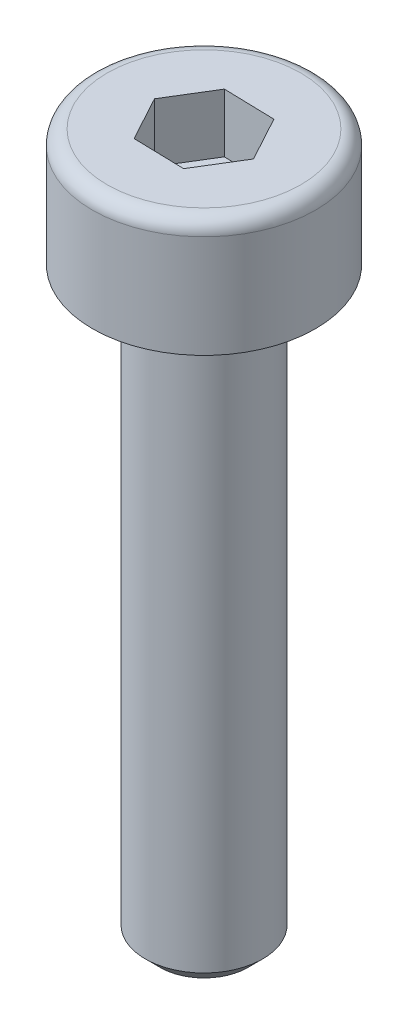
ISO-10303-21;
HEADER;
FILE_DESCRIPTION(('STEP AP214'),'2;1');
FILE_NAME('part.step','',(''),(''),'','','');
FILE_SCHEMA(('AUTOMOTIVE_DESIGN { 1 0 10303 214 1 1 1 1 }'));
ENDSEC;
DATA;
#1=APPLICATION_CONTEXT('core data for automotive mechanical design processes');
#2=APPLICATION_PROTOCOL_DEFINITION('international standard','automotive_design',2000,#1);
#3=PRODUCT_CONTEXT('',#1,'mechanical');
#4=PRODUCT('Part','Part','',(#3));
#5=PRODUCT_RELATED_PRODUCT_CATEGORY('part','',(#4));
#6=PRODUCT_DEFINITION_FORMATION('','',#4);
#7=PRODUCT_DEFINITION_CONTEXT('part definition',#1,'design');
#8=PRODUCT_DEFINITION('design','',#6,#7);
#9=PRODUCT_DEFINITION_SHAPE('','',#8);
#10=(LENGTH_UNIT() NAMED_UNIT(*) SI_UNIT(.MILLI.,.METRE.));
#11=(NAMED_UNIT(*) PLANE_ANGLE_UNIT() SI_UNIT($,.RADIAN.));
#12=(NAMED_UNIT(*) SI_UNIT($,.STERADIAN.) SOLID_ANGLE_UNIT());
#13=UNCERTAINTY_MEASURE_WITH_UNIT(LENGTH_MEASURE(1.E-05),#10,'distance_accuracy_value','');
#14=(GEOMETRIC_REPRESENTATION_CONTEXT(3) GLOBAL_UNCERTAINTY_ASSIGNED_CONTEXT((#13)) GLOBAL_UNIT_ASSIGNED_CONTEXT((#10,
#11,#12)) REPRESENTATION_CONTEXT('',''));
#15=CARTESIAN_POINT('',(0.,0.,0.));
#16=DIRECTION('',(0.,0.,1.));
#17=DIRECTION('',(1.,0.,0.));
#18=AXIS2_PLACEMENT_3D('',#15,#16,#17);
#19=CARTESIAN_POINT('',(0.,2.,0.));
#20=DIRECTION('',(0.,-1.,0.));
#21=DIRECTION('',(0.,0.,-1.));
#22=AXIS2_PLACEMENT_3D('',#19,#20,#21);
#23=CYLINDRICAL_SURFACE('',#22,1.9);
#24=CARTESIAN_POINT('',(0.,1.75,0.));
#25=DIRECTION('',(0.,1.,0.));
#26=DIRECTION('',(0.,0.,1.));
#27=AXIS2_PLACEMENT_3D('',#24,#25,#26);
#28=CIRCLE('',#27,1.9);
#29=CARTESIAN_POINT('',(0.,1.75,1.9));
#30=VERTEX_POINT('',#29);
#31=EDGE_CURVE('E148',#30,#30,#28,.F.);
#32=ORIENTED_EDGE('',*,*,#31,.T.);
#33=EDGE_LOOP('',(#32));
#34=FACE_BOUND('',#33,.T.);
#35=CARTESIAN_POINT('',(0.,0.,0.));
#36=DIRECTION('',(0.,1.,0.));
#37=DIRECTION('',(0.,0.,1.));
#38=AXIS2_PLACEMENT_3D('',#35,#36,#37);
#39=CIRCLE('',#38,1.9);
#40=CARTESIAN_POINT('',(0.,0.,1.9));
#41=VERTEX_POINT('',#40);
#42=EDGE_CURVE('E139',#41,#41,#39,.T.);
#43=ORIENTED_EDGE('',*,*,#42,.T.);
#44=EDGE_LOOP('',(#43));
#45=FACE_BOUND('',#44,.T.);
#46=ADVANCED_FACE('F37',(#34,#45),#23,.T.);
#47=CARTESIAN_POINT('',(0.,2.,0.));
#48=DIRECTION('',(0.,1.,0.));
#49=DIRECTION('',(0.,0.,1.));
#50=AXIS2_PLACEMENT_3D('',#47,#48,#49);
#51=PLANE('',#50);
#52=DIRECTION('',(-0.477309128780898,0.,-0.878735452558061));
#53=VECTOR('',#52,1.);
#54=CARTESIAN_POINT('',(0.865732504909784,2.,0.0225217659749745));
#55=LINE('',#54,#53);
#56=CARTESIAN_POINT('',(0.865732504909784,2.,0.0225217659749745));
#57=VERTEX_POINT('',#56);
#58=CARTESIAN_POINT('',(0.452370673927308,2.,-0.738485459146322));
#59=VERTEX_POINT('',#58);
#60=EDGE_CURVE('E52',#57,#59,#55,.T.);
#61=ORIENTED_EDGE('',*,*,#60,.F.);
#62=DIRECTION('',(0.522352660730847,0.,-0.852729557261506));
#63=VECTOR('',#62,1.);
#64=CARTESIAN_POINT('',(0.413361830982476,2.,0.761007225121296));
#65=LINE('',#64,#63);
#66=CARTESIAN_POINT('',(0.413361830982476,2.,0.761007225121296));
#67=VERTEX_POINT('',#66);
#68=EDGE_CURVE('E135',#67,#57,#65,.T.);
#69=ORIENTED_EDGE('',*,*,#68,.F.);
#70=DIRECTION('',(0.999661789511745,0.,0.0260058952965545));
#71=VECTOR('',#70,1.);
#72=CARTESIAN_POINT('',(-0.452370673927308,2.,0.738485459146322));
#73=LINE('',#72,#71);
#74=CARTESIAN_POINT('',(-0.452370673927308,2.,0.738485459146322));
#75=VERTEX_POINT('',#74);
#76=EDGE_CURVE('E133',#75,#67,#73,.T.);
#77=ORIENTED_EDGE('',*,*,#76,.F.);
#78=DIRECTION('',(0.477309128780898,0.,0.878735452558061));
#79=VECTOR('',#78,1.);
#80=CARTESIAN_POINT('',(-0.865732504909783,2.,-0.0225217659749746));
#81=LINE('',#80,#79);
#82=CARTESIAN_POINT('',(-0.865732504909783,2.,-0.0225217659749746));
#83=VERTEX_POINT('',#82);
#84=EDGE_CURVE('E100',#83,#75,#81,.T.);
#85=ORIENTED_EDGE('',*,*,#84,.F.);
#86=DIRECTION('',(-0.522352660730847,0.,0.852729557261506));
#87=VECTOR('',#86,1.);
#88=CARTESIAN_POINT('',(-0.413361830982476,2.,-0.761007225121296));
#89=LINE('',#88,#87);
#90=CARTESIAN_POINT('',(-0.413361830982476,2.,-0.761007225121296));
#91=VERTEX_POINT('',#90);
#92=EDGE_CURVE('E129',#91,#83,#89,.T.);
#93=ORIENTED_EDGE('',*,*,#92,.F.);
#94=DIRECTION('',(-0.999661789511745,0.,-0.0260058952965545));
#95=VECTOR('',#94,1.);
#96=CARTESIAN_POINT('',(0.452370673927308,2.,-0.738485459146322));
#97=LINE('',#96,#95);
#98=EDGE_CURVE('E126',#59,#91,#97,.T.);
#99=ORIENTED_EDGE('',*,*,#98,.F.);
#100=EDGE_LOOP('',(#61,#69,#77,#85,#93,#99));
#101=FACE_BOUND('',#100,.T.);
#102=CARTESIAN_POINT('',(0.,2.,0.));
#103=DIRECTION('',(0.,1.,0.));
#104=DIRECTION('',(0.,0.,1.));
#105=AXIS2_PLACEMENT_3D('',#102,#103,#104);
#106=CIRCLE('',#105,1.65);
#107=CARTESIAN_POINT('',(0.,2.,1.65));
#108=VERTEX_POINT('',#107);
#109=EDGE_CURVE('E151',#108,#108,#106,.T.);
#110=ORIENTED_EDGE('',*,*,#109,.T.);
#111=EDGE_LOOP('',(#110));
#112=FACE_BOUND('',#111,.T.);
#113=ADVANCED_FACE('F169',(#101,#112),#51,.T.);
#114=CARTESIAN_POINT('',(0.,0.,0.));
#115=DIRECTION('',(0.,1.,0.));
#116=DIRECTION('',(0.,0.,1.));
#117=AXIS2_PLACEMENT_3D('',#114,#115,#116);
#118=PLANE('',#117);
#119=CARTESIAN_POINT('',(0.,0.,0.));
#120=DIRECTION('',(0.,-1.,0.));
#121=DIRECTION('',(0.,0.,-1.));
#122=AXIS2_PLACEMENT_3D('',#119,#120,#121);
#123=CIRCLE('',#122,1.);
#124=CARTESIAN_POINT('',(0.,0.,-1.));
#125=VERTEX_POINT('',#124);
#126=EDGE_CURVE('E145',#125,#125,#123,.T.);
#127=ORIENTED_EDGE('',*,*,#126,.F.);
#128=EDGE_LOOP('',(#127));
#129=FACE_BOUND('',#128,.T.);
#130=ORIENTED_EDGE('',*,*,#42,.F.);
#131=EDGE_LOOP('',(#130));
#132=FACE_BOUND('',#131,.T.);
#133=ADVANCED_FACE('F175',(#129,#132),#118,.F.);
#134=CARTESIAN_POINT('',(0.,1.75,0.));
#135=DIRECTION('',(0.,1.,0.));
#136=DIRECTION('',(0.,0.,1.));
#137=AXIS2_PLACEMENT_3D('',#134,#135,#136);
#138=TOROIDAL_SURFACE('',#137,1.65,0.25);
#139=ORIENTED_EDGE('',*,*,#31,.F.);
#140=EDGE_LOOP('',(#139));
#141=FACE_BOUND('',#140,.T.);
#142=ORIENTED_EDGE('',*,*,#109,.F.);
#143=EDGE_LOOP('',(#142));
#144=FACE_BOUND('',#143,.T.);
#145=ADVANCED_FACE('F180',(#141,#144),#138,.T.);
#146=CARTESIAN_POINT('',(0.,-10.,0.));
#147=DIRECTION('',(0.,1.,0.));
#148=DIRECTION('',(0.,0.,1.));
#149=AXIS2_PLACEMENT_3D('',#146,#147,#148);
#150=CYLINDRICAL_SURFACE('',#149,1.);
#151=CARTESIAN_POINT('',(0.,-9.75,0.));
#152=DIRECTION('',(0.,-1.,0.));
#153=DIRECTION('',(0.,0.,-1.));
#154=AXIS2_PLACEMENT_3D('',#151,#152,#153);
#155=CIRCLE('',#154,1.);
#156=CARTESIAN_POINT('',(0.,-9.75,-1.));
#157=VERTEX_POINT('',#156);
#158=EDGE_CURVE('E11',#157,#157,#155,.F.);
#159=ORIENTED_EDGE('',*,*,#158,.T.);
#160=EDGE_LOOP('',(#159));
#161=FACE_BOUND('',#160,.T.);
#162=ORIENTED_EDGE('',*,*,#126,.T.);
#163=EDGE_LOOP('',(#162));
#164=FACE_BOUND('',#163,.T.);
#165=ADVANCED_FACE('F182',(#161,#164),#150,.T.);
#166=CARTESIAN_POINT('',(0.,-10.,0.));
#167=DIRECTION('',(0.,-1.,0.));
#168=DIRECTION('',(0.,0.,-1.));
#169=AXIS2_PLACEMENT_3D('',#166,#167,#168);
#170=PLANE('',#169);
#171=CARTESIAN_POINT('',(0.,-10.,0.));
#172=DIRECTION('',(0.,-1.,0.));
#173=DIRECTION('',(0.,0.,-1.));
#174=AXIS2_PLACEMENT_3D('',#171,#172,#173);
#175=CIRCLE('',#174,0.750000000000001);
#176=CARTESIAN_POINT('',(0.,-10.,-0.750000000000001));
#177=VERTEX_POINT('',#176);
#178=EDGE_CURVE('E45',#177,#177,#175,.T.);
#179=ORIENTED_EDGE('',*,*,#178,.T.);
#180=EDGE_LOOP('',(#179));
#181=FACE_BOUND('',#180,.T.);
#182=ADVANCED_FACE('F158',(#181),#170,.T.);
#183=CARTESIAN_POINT('',(0.865732504909784,1.,0.0225217659749745));
#184=DIRECTION('',(0.878735452558061,0.,-0.477309128780898));
#185=DIRECTION('',(-0.477309128780898,0.,-0.878735452558061));
#186=AXIS2_PLACEMENT_3D('',#183,#184,#185);
#187=PLANE('',#186);
#188=ORIENTED_EDGE('',*,*,#60,.T.);
#189=DIRECTION('',(0.,1.,0.));
#190=VECTOR('',#189,1.);
#191=CARTESIAN_POINT('',(0.452370673927308,1.,-0.738485459146322));
#192=LINE('',#191,#190);
#193=CARTESIAN_POINT('',(0.452370673927308,1.,-0.738485459146322));
#194=VERTEX_POINT('',#193);
#195=EDGE_CURVE('E82',#194,#59,#192,.T.);
#196=ORIENTED_EDGE('',*,*,#195,.F.);
#197=DIRECTION('',(-0.477309128780898,0.,-0.878735452558061));
#198=VECTOR('',#197,1.);
#199=CARTESIAN_POINT('',(0.865732504909784,1.,0.0225217659749745));
#200=LINE('',#199,#198);
#201=CARTESIAN_POINT('',(0.865732504909784,1.,0.0225217659749745));
#202=VERTEX_POINT('',#201);
#203=EDGE_CURVE('E137',#202,#194,#200,.T.);
#204=ORIENTED_EDGE('',*,*,#203,.F.);
#205=DIRECTION('',(0.,1.,0.));
#206=VECTOR('',#205,1.);
#207=CARTESIAN_POINT('',(0.865732504909784,1.,0.0225217659749745));
#208=LINE('',#207,#206);
#209=EDGE_CURVE('E60',#202,#57,#208,.T.);
#210=ORIENTED_EDGE('',*,*,#209,.T.);
#211=EDGE_LOOP('',(#188,#196,#204,#210));
#212=FACE_BOUND('',#211,.T.);
#213=ADVANCED_FACE('F211',(#212),#187,.F.);
#214=CARTESIAN_POINT('',(0.413361830982476,1.,0.761007225121296));
#215=DIRECTION('',(0.852729557261506,0.,0.522352660730847));
#216=DIRECTION('',(0.522352660730847,0.,-0.852729557261506));
#217=AXIS2_PLACEMENT_3D('',#214,#215,#216);
#218=PLANE('',#217);
#219=ORIENTED_EDGE('',*,*,#68,.T.);
#220=ORIENTED_EDGE('',*,*,#209,.F.);
#221=DIRECTION('',(0.522352660730847,0.,-0.852729557261506));
#222=VECTOR('',#221,1.);
#223=CARTESIAN_POINT('',(0.413361830982476,1.,0.761007225121296));
#224=LINE('',#223,#222);
#225=CARTESIAN_POINT('',(0.413361830982476,1.,0.761007225121296));
#226=VERTEX_POINT('',#225);
#227=EDGE_CURVE('E112',#226,#202,#224,.T.);
#228=ORIENTED_EDGE('',*,*,#227,.F.);
#229=DIRECTION('',(0.,1.,0.));
#230=VECTOR('',#229,1.);
#231=CARTESIAN_POINT('',(0.413361830982476,1.,0.761007225121296));
#232=LINE('',#231,#230);
#233=EDGE_CURVE('E104',#226,#67,#232,.T.);
#234=ORIENTED_EDGE('',*,*,#233,.T.);
#235=EDGE_LOOP('',(#219,#220,#228,#234));
#236=FACE_BOUND('',#235,.T.);
#237=ADVANCED_FACE('F216',(#236),#218,.F.);
#238=CARTESIAN_POINT('',(-0.452370673927308,1.,0.738485459146322));
#239=DIRECTION('',(-0.0260058952965545,0.,0.999661789511745));
#240=DIRECTION('',(0.999661789511745,0.,0.0260058952965545));
#241=AXIS2_PLACEMENT_3D('',#238,#239,#240);
#242=PLANE('',#241);
#243=ORIENTED_EDGE('',*,*,#76,.T.);
#244=ORIENTED_EDGE('',*,*,#233,.F.);
#245=DIRECTION('',(0.999661789511745,0.,0.0260058952965545));
#246=VECTOR('',#245,1.);
#247=CARTESIAN_POINT('',(-0.452370673927308,1.,0.738485459146322));
#248=LINE('',#247,#246);
#249=CARTESIAN_POINT('',(-0.452370673927308,1.,0.738485459146322));
#250=VERTEX_POINT('',#249);
#251=EDGE_CURVE('E108',#250,#226,#248,.T.);
#252=ORIENTED_EDGE('',*,*,#251,.F.);
#253=DIRECTION('',(0.,1.,0.));
#254=VECTOR('',#253,1.);
#255=CARTESIAN_POINT('',(-0.452370673927308,1.,0.738485459146322));
#256=LINE('',#255,#254);
#257=EDGE_CURVE('E93',#250,#75,#256,.T.);
#258=ORIENTED_EDGE('',*,*,#257,.T.);
#259=EDGE_LOOP('',(#243,#244,#252,#258));
#260=FACE_BOUND('',#259,.T.);
#261=ADVANCED_FACE('F109',(#260),#242,.F.);
#262=CARTESIAN_POINT('',(-0.865732504909783,1.,-0.0225217659749746));
#263=DIRECTION('',(-0.878735452558061,0.,0.477309128780898));
#264=DIRECTION('',(0.477309128780898,0.,0.878735452558061));
#265=AXIS2_PLACEMENT_3D('',#262,#263,#264);
#266=PLANE('',#265);
#267=ORIENTED_EDGE('',*,*,#84,.T.);
#268=ORIENTED_EDGE('',*,*,#257,.F.);
#269=DIRECTION('',(0.477309128780898,0.,0.878735452558061));
#270=VECTOR('',#269,1.);
#271=CARTESIAN_POINT('',(-0.865732504909783,1.,-0.0225217659749746));
#272=LINE('',#271,#270);
#273=CARTESIAN_POINT('',(-0.865732504909783,1.,-0.0225217659749746));
#274=VERTEX_POINT('',#273);
#275=EDGE_CURVE('E97',#274,#250,#272,.T.);
#276=ORIENTED_EDGE('',*,*,#275,.F.);
#277=DIRECTION('',(0.,1.,0.));
#278=VECTOR('',#277,1.);
#279=CARTESIAN_POINT('',(-0.865732504909783,1.,-0.0225217659749746));
#280=LINE('',#279,#278);
#281=EDGE_CURVE('E105',#274,#83,#280,.T.);
#282=ORIENTED_EDGE('',*,*,#281,.T.);
#283=EDGE_LOOP('',(#267,#268,#276,#282));
#284=FACE_BOUND('',#283,.T.);
#285=ADVANCED_FACE('F95',(#284),#266,.F.);
#286=CARTESIAN_POINT('',(-0.413361830982476,1.,-0.761007225121296));
#287=DIRECTION('',(-0.852729557261506,0.,-0.522352660730847));
#288=DIRECTION('',(-0.522352660730847,0.,0.852729557261506));
#289=AXIS2_PLACEMENT_3D('',#286,#287,#288);
#290=PLANE('',#289);
#291=ORIENTED_EDGE('',*,*,#92,.T.);
#292=ORIENTED_EDGE('',*,*,#281,.F.);
#293=DIRECTION('',(-0.522352660730847,0.,0.852729557261506));
#294=VECTOR('',#293,1.);
#295=CARTESIAN_POINT('',(-0.413361830982476,1.,-0.761007225121296));
#296=LINE('',#295,#294);
#297=CARTESIAN_POINT('',(-0.413361830982476,1.,-0.761007225121296));
#298=VERTEX_POINT('',#297);
#299=EDGE_CURVE('E118',#298,#274,#296,.T.);
#300=ORIENTED_EDGE('',*,*,#299,.F.);
#301=DIRECTION('',(0.,1.,0.));
#302=VECTOR('',#301,1.);
#303=CARTESIAN_POINT('',(-0.413361830982476,1.,-0.761007225121296));
#304=LINE('',#303,#302);
#305=EDGE_CURVE('E142',#298,#91,#304,.T.);
#306=ORIENTED_EDGE('',*,*,#305,.T.);
#307=EDGE_LOOP('',(#291,#292,#300,#306));
#308=FACE_BOUND('',#307,.T.);
#309=ADVANCED_FACE('F243',(#308),#290,.F.);
#310=CARTESIAN_POINT('',(0.452370673927308,1.,-0.738485459146322));
#311=DIRECTION('',(0.0260058952965545,0.,-0.999661789511745));
#312=DIRECTION('',(-0.999661789511745,0.,-0.0260058952965545));
#313=AXIS2_PLACEMENT_3D('',#310,#311,#312);
#314=PLANE('',#313);
#315=ORIENTED_EDGE('',*,*,#98,.T.);
#316=ORIENTED_EDGE('',*,*,#305,.F.);
#317=DIRECTION('',(-0.999661789511745,0.,-0.0260058952965545));
#318=VECTOR('',#317,1.);
#319=CARTESIAN_POINT('',(0.452370673927308,1.,-0.738485459146322));
#320=LINE('',#319,#318);
#321=EDGE_CURVE('E120',#194,#298,#320,.T.);
#322=ORIENTED_EDGE('',*,*,#321,.F.);
#323=ORIENTED_EDGE('',*,*,#195,.T.);
#324=EDGE_LOOP('',(#315,#316,#322,#323));
#325=FACE_BOUND('',#324,.T.);
#326=ADVANCED_FACE('F165',(#325),#314,.F.);
#327=CARTESIAN_POINT('',(0.,1.,0.));
#328=DIRECTION('',(0.,1.,0.));
#329=DIRECTION('',(0.,0.,1.));
#330=AXIS2_PLACEMENT_3D('',#327,#328,#329);
#331=PLANE('',#330);
#332=ORIENTED_EDGE('',*,*,#203,.T.);
#333=ORIENTED_EDGE('',*,*,#321,.T.);
#334=ORIENTED_EDGE('',*,*,#299,.T.);
#335=ORIENTED_EDGE('',*,*,#275,.T.);
#336=ORIENTED_EDGE('',*,*,#251,.T.);
#337=ORIENTED_EDGE('',*,*,#227,.T.);
#338=EDGE_LOOP('',(#332,#333,#334,#335,#336,#337));
#339=FACE_BOUND('',#338,.T.);
#340=ADVANCED_FACE('F115',(#339),#331,.T.);
#341=CARTESIAN_POINT('',(0.,-10.,0.));
#342=DIRECTION('',(0.,1.,0.));
#343=DIRECTION('',(0.,0.,1.));
#344=AXIS2_PLACEMENT_3D('',#341,#342,#343);
#345=CONICAL_SURFACE('',#344,0.750000000000001,0.785398163397443);
#346=ORIENTED_EDGE('',*,*,#158,.F.);
#347=EDGE_LOOP('',(#346));
#348=FACE_BOUND('',#347,.T.);
#349=ORIENTED_EDGE('',*,*,#178,.F.);
#350=EDGE_LOOP('',(#349));
#351=FACE_BOUND('',#350,.T.);
#352=ADVANCED_FACE('F39',(#348,#351),#345,.T.);
#353=CLOSED_SHELL('',(#46,#113,#133,#145,#165,#182,#213,#237,#261,#285,#309,#326,#340,#352));
#354=MANIFOLD_SOLID_BREP('B2',#353);
#355=ADVANCED_BREP_SHAPE_REPRESENTATION('',(#18,#354),#14);
#356=SHAPE_DEFINITION_REPRESENTATION(#9,#355);
ENDSEC;
END-ISO-10303-21;
